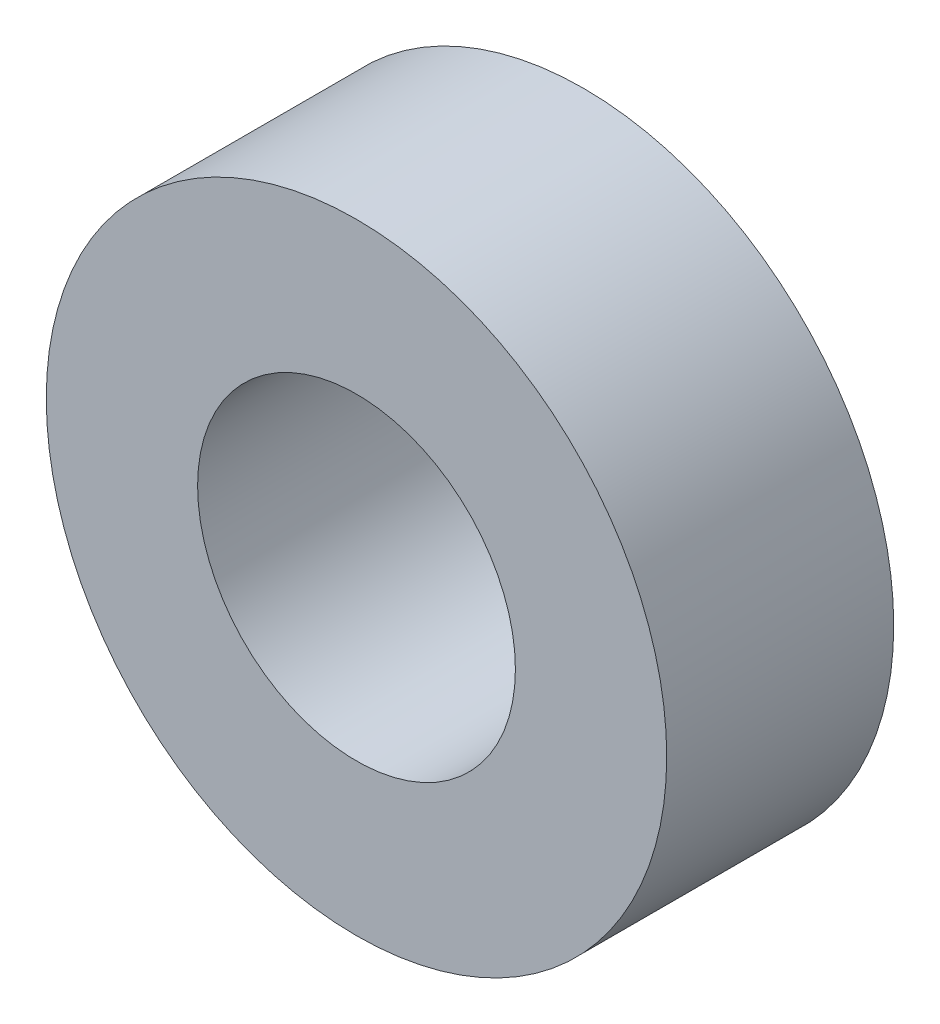
ISO-10303-21;
HEADER;
FILE_DESCRIPTION(('STEP AP214'),'2;1');
FILE_NAME('part.step','',(''),(''),'','','');
FILE_SCHEMA(('AUTOMOTIVE_DESIGN { 1 0 10303 214 1 1 1 1 }'));
ENDSEC;
DATA;
#1=APPLICATION_CONTEXT('core data for automotive mechanical design processes');
#2=APPLICATION_PROTOCOL_DEFINITION('international standard','automotive_design',2000,#1);
#3=PRODUCT_CONTEXT('',#1,'mechanical');
#4=PRODUCT('Part','Part','',(#3));
#5=PRODUCT_RELATED_PRODUCT_CATEGORY('part','',(#4));
#6=PRODUCT_DEFINITION_FORMATION('','',#4);
#7=PRODUCT_DEFINITION_CONTEXT('part definition',#1,'design');
#8=PRODUCT_DEFINITION('design','',#6,#7);
#9=PRODUCT_DEFINITION_SHAPE('','',#8);
#10=(LENGTH_UNIT() NAMED_UNIT(*) SI_UNIT(.MILLI.,.METRE.));
#11=(NAMED_UNIT(*) PLANE_ANGLE_UNIT() SI_UNIT($,.RADIAN.));
#12=(NAMED_UNIT(*) SI_UNIT($,.STERADIAN.) SOLID_ANGLE_UNIT());
#13=UNCERTAINTY_MEASURE_WITH_UNIT(LENGTH_MEASURE(1.E-05),#10,'distance_accuracy_value','');
#14=(GEOMETRIC_REPRESENTATION_CONTEXT(3) GLOBAL_UNCERTAINTY_ASSIGNED_CONTEXT((#13)) GLOBAL_UNIT_ASSIGNED_CONTEXT((#10,
#11,#12)) REPRESENTATION_CONTEXT('',''));
#15=CARTESIAN_POINT('',(0.,0.,0.));
#16=DIRECTION('',(0.,0.,1.));
#17=DIRECTION('',(1.,0.,0.));
#18=AXIS2_PLACEMENT_3D('',#15,#16,#17);
#19=CARTESIAN_POINT('',(0.,0.,1.5));
#20=DIRECTION('',(0.,0.,1.));
#21=DIRECTION('',(1.,0.,0.));
#22=AXIS2_PLACEMENT_3D('',#19,#20,#21);
#23=PLANE('',#22);
#24=CARTESIAN_POINT('',(0.,0.,1.5));
#25=DIRECTION('',(0.,0.,1.));
#26=DIRECTION('',(1.,0.,0.));
#27=AXIS2_PLACEMENT_3D('',#24,#25,#26);
#28=CIRCLE('',#27,2.05);
#29=CARTESIAN_POINT('',(2.05,0.,1.5));
#30=VERTEX_POINT('',#29);
#31=EDGE_CURVE('E11',#30,#30,#28,.T.);
#32=ORIENTED_EDGE('',*,*,#31,.T.);
#33=EDGE_LOOP('',(#32));
#34=FACE_BOUND('',#33,.T.);
#35=CARTESIAN_POINT('',(0.,0.,1.5));
#36=DIRECTION('',(0.,0.,1.));
#37=DIRECTION('',(1.,0.,0.));
#38=AXIS2_PLACEMENT_3D('',#35,#36,#37);
#39=CIRCLE('',#38,1.05);
#40=CARTESIAN_POINT('',(1.05,0.,1.5));
#41=VERTEX_POINT('',#40);
#42=EDGE_CURVE('E56',#41,#41,#39,.T.);
#43=ORIENTED_EDGE('',*,*,#42,.F.);
#44=EDGE_LOOP('',(#43));
#45=FACE_BOUND('',#44,.T.);
#46=ADVANCED_FACE('F43',(#34,#45),#23,.T.);
#47=CARTESIAN_POINT('',(0.,0.,0.));
#48=DIRECTION('',(0.,0.,1.));
#49=DIRECTION('',(1.,0.,0.));
#50=AXIS2_PLACEMENT_3D('',#47,#48,#49);
#51=PLANE('',#50);
#52=CARTESIAN_POINT('',(0.,0.,0.));
#53=DIRECTION('',(0.,0.,1.));
#54=DIRECTION('',(1.,0.,0.));
#55=AXIS2_PLACEMENT_3D('',#52,#53,#54);
#56=CIRCLE('',#55,2.05);
#57=CARTESIAN_POINT('',(2.05,0.,0.));
#58=VERTEX_POINT('',#57);
#59=EDGE_CURVE('E47',#58,#58,#56,.T.);
#60=ORIENTED_EDGE('',*,*,#59,.F.);
#61=EDGE_LOOP('',(#60));
#62=FACE_BOUND('',#61,.T.);
#63=CARTESIAN_POINT('',(0.,0.,0.));
#64=DIRECTION('',(0.,0.,1.));
#65=DIRECTION('',(1.,0.,0.));
#66=AXIS2_PLACEMENT_3D('',#63,#64,#65);
#67=CIRCLE('',#66,1.05);
#68=CARTESIAN_POINT('',(1.05,0.,0.));
#69=VERTEX_POINT('',#68);
#70=EDGE_CURVE('E58',#69,#69,#67,.T.);
#71=ORIENTED_EDGE('',*,*,#70,.T.);
#72=EDGE_LOOP('',(#71));
#73=FACE_BOUND('',#72,.T.);
#74=ADVANCED_FACE('F70',(#62,#73),#51,.F.);
#75=CARTESIAN_POINT('',(0.,0.,1.5));
#76=DIRECTION('',(0.,0.,-1.));
#77=DIRECTION('',(-1.,0.,0.));
#78=AXIS2_PLACEMENT_3D('',#75,#76,#77);
#79=CYLINDRICAL_SURFACE('',#78,2.05);
#80=ORIENTED_EDGE('',*,*,#31,.F.);
#81=EDGE_LOOP('',(#80));
#82=FACE_BOUND('',#81,.T.);
#83=ORIENTED_EDGE('',*,*,#59,.T.);
#84=EDGE_LOOP('',(#83));
#85=FACE_BOUND('',#84,.T.);
#86=ADVANCED_FACE('F45',(#82,#85),#79,.T.);
#87=CARTESIAN_POINT('',(0.,0.,1.5));
#88=DIRECTION('',(0.,0.,-1.));
#89=DIRECTION('',(-1.,0.,0.));
#90=AXIS2_PLACEMENT_3D('',#87,#88,#89);
#91=CYLINDRICAL_SURFACE('',#90,1.05);
#92=ORIENTED_EDGE('',*,*,#42,.T.);
#93=EDGE_LOOP('',(#92));
#94=FACE_BOUND('',#93,.T.);
#95=ORIENTED_EDGE('',*,*,#70,.F.);
#96=EDGE_LOOP('',(#95));
#97=FACE_BOUND('',#96,.T.);
#98=ADVANCED_FACE('F66',(#94,#97),#91,.F.);
#99=CLOSED_SHELL('',(#46,#74,#86,#98));
#100=MANIFOLD_SOLID_BREP('B2',#99);
#101=ADVANCED_BREP_SHAPE_REPRESENTATION('',(#18,#100),#14);
#102=SHAPE_DEFINITION_REPRESENTATION(#9,#101);
ENDSEC;
END-ISO-10303-21;
